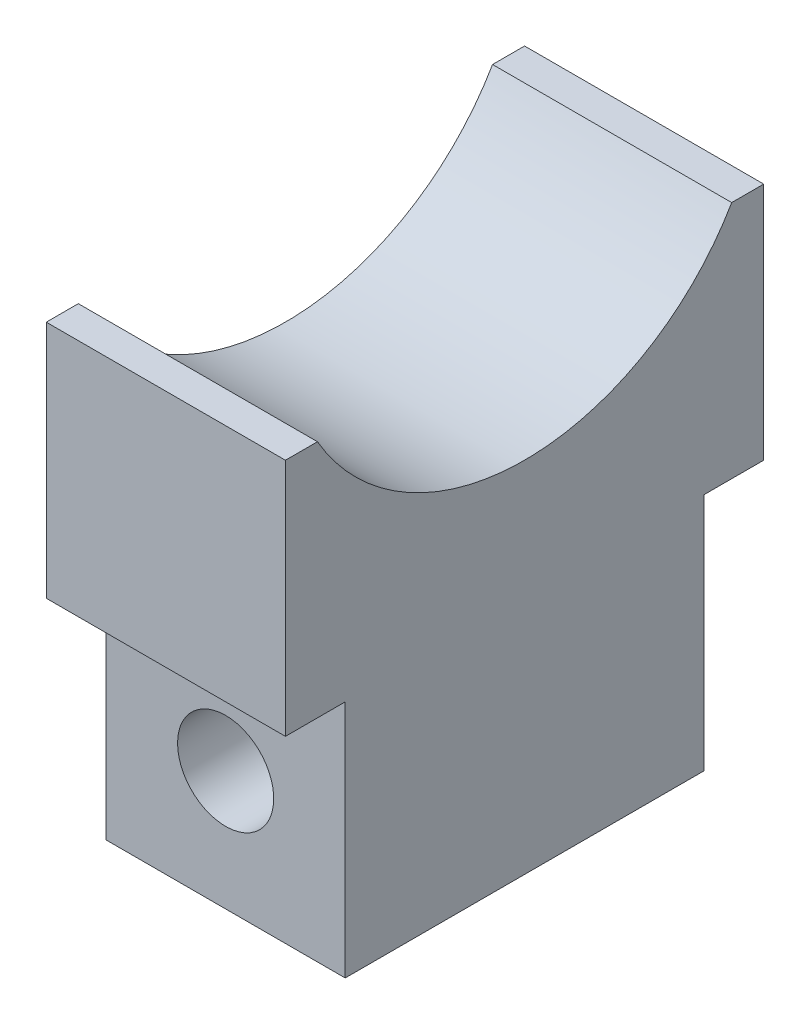
ISO-10303-21;
HEADER;
FILE_DESCRIPTION(('STEP AP214'),'2;1');
FILE_NAME('part.step','',(''),(''),'','','');
FILE_SCHEMA(('AUTOMOTIVE_DESIGN { 1 0 10303 214 1 1 1 1 }'));
ENDSEC;
DATA;
#1=APPLICATION_CONTEXT('core data for automotive mechanical design processes');
#2=APPLICATION_PROTOCOL_DEFINITION('international standard','automotive_design',2000,#1);
#3=PRODUCT_CONTEXT('',#1,'mechanical');
#4=PRODUCT('Part','Part','',(#3));
#5=PRODUCT_RELATED_PRODUCT_CATEGORY('part','',(#4));
#6=PRODUCT_DEFINITION_FORMATION('','',#4);
#7=PRODUCT_DEFINITION_CONTEXT('part definition',#1,'design');
#8=PRODUCT_DEFINITION('design','',#6,#7);
#9=PRODUCT_DEFINITION_SHAPE('','',#8);
#10=(LENGTH_UNIT() NAMED_UNIT(*) SI_UNIT(.MILLI.,.METRE.));
#11=(NAMED_UNIT(*) PLANE_ANGLE_UNIT() SI_UNIT($,.RADIAN.));
#12=(NAMED_UNIT(*) SI_UNIT($,.STERADIAN.) SOLID_ANGLE_UNIT());
#13=UNCERTAINTY_MEASURE_WITH_UNIT(LENGTH_MEASURE(1.E-05),#10,'distance_accuracy_value','');
#14=(GEOMETRIC_REPRESENTATION_CONTEXT(3) GLOBAL_UNCERTAINTY_ASSIGNED_CONTEXT((#13)) GLOBAL_UNIT_ASSIGNED_CONTEXT((#10,
#11,#12)) REPRESENTATION_CONTEXT('',''));
#15=CARTESIAN_POINT('',(0.,0.,0.));
#16=DIRECTION('',(0.,0.,1.));
#17=DIRECTION('',(1.,0.,0.));
#18=AXIS2_PLACEMENT_3D('',#15,#16,#17);
#19=CARTESIAN_POINT('',(6.35,12.7,25.4));
#20=DIRECTION('',(0.,-1.,0.));
#21=DIRECTION('',(0.,0.,-1.));
#22=AXIS2_PLACEMENT_3D('',#19,#20,#21);
#23=PLANE('',#22);
#24=DIRECTION('',(0.,0.,-1.));
#25=VECTOR('',#24,1.);
#26=CARTESIAN_POINT('',(6.35,12.7,25.4));
#27=LINE('',#26,#25);
#28=CARTESIAN_POINT('',(6.35,12.7,25.4));
#29=VERTEX_POINT('',#28);
#30=CARTESIAN_POINT('',(6.35,12.7,23.6985226280624));
#31=VERTEX_POINT('',#30);
#32=EDGE_CURVE('E195',#29,#31,#27,.T.);
#33=ORIENTED_EDGE('',*,*,#32,.T.);
#34=DIRECTION('',(-1.,0.,0.));
#35=VECTOR('',#34,1.);
#36=CARTESIAN_POINT('',(6.35,12.7,23.6985226280624));
#37=LINE('',#36,#35);
#38=CARTESIAN_POINT('',(-6.35,12.7,23.6985226280624));
#39=VERTEX_POINT('',#38);
#40=EDGE_CURVE('E186',#31,#39,#37,.T.);
#41=ORIENTED_EDGE('',*,*,#40,.T.);
#42=DIRECTION('',(0.,0.,-1.));
#43=VECTOR('',#42,1.);
#44=CARTESIAN_POINT('',(-6.35,12.7,25.4));
#45=LINE('',#44,#43);
#46=CARTESIAN_POINT('',(-6.35,12.7,25.4));
#47=VERTEX_POINT('',#46);
#48=EDGE_CURVE('E190',#47,#39,#45,.T.);
#49=ORIENTED_EDGE('',*,*,#48,.F.);
#50=DIRECTION('',(-1.,0.,0.));
#51=VECTOR('',#50,1.);
#52=CARTESIAN_POINT('',(6.35,12.7,25.4));
#53=LINE('',#52,#51);
#54=EDGE_CURVE('E221',#29,#47,#53,.T.);
#55=ORIENTED_EDGE('',*,*,#54,.F.);
#56=EDGE_LOOP('',(#33,#41,#49,#55));
#57=FACE_BOUND('',#56,.T.);
#58=ADVANCED_FACE('F79',(#57),#23,.F.);
#59=CARTESIAN_POINT('',(-6.35,-12.7,25.4));
#60=DIRECTION('',(1.,0.,0.));
#61=DIRECTION('',(0.,0.,-1.));
#62=AXIS2_PLACEMENT_3D('',#59,#60,#61);
#63=PLANE('',#62);
#64=ORIENTED_EDGE('',*,*,#48,.T.);
#65=CARTESIAN_POINT('',(-6.35,19.05,12.7));
#66=DIRECTION('',(-1.,0.,0.));
#67=DIRECTION('',(0.,0.,1.));
#68=AXIS2_PLACEMENT_3D('',#65,#66,#67);
#69=CIRCLE('',#68,12.7);
#70=CARTESIAN_POINT('',(-6.35,12.7,1.70147737193763));
#71=VERTEX_POINT('',#70);
#72=EDGE_CURVE('E228',#71,#39,#69,.T.);
#73=ORIENTED_EDGE('',*,*,#72,.F.);
#74=CARTESIAN_POINT('',(-6.35,12.7,0.));
#75=VERTEX_POINT('',#74);
#76=EDGE_CURVE('E194',#71,#75,#45,.T.);
#77=ORIENTED_EDGE('',*,*,#76,.T.);
#78=DIRECTION('',(0.,-1.,0.));
#79=VECTOR('',#78,1.);
#80=CARTESIAN_POINT('',(-6.35,-12.7,0.));
#81=LINE('',#80,#79);
#82=CARTESIAN_POINT('',(-6.35,0.,0.));
#83=VERTEX_POINT('',#82);
#84=EDGE_CURVE('E182',#75,#83,#81,.T.);
#85=ORIENTED_EDGE('',*,*,#84,.T.);
#86=DIRECTION('',(0.,0.,-1.));
#87=VECTOR('',#86,1.);
#88=CARTESIAN_POINT('',(-6.35,0.,0.));
#89=LINE('',#88,#87);
#90=CARTESIAN_POINT('',(-6.35,0.,3.175));
#91=VERTEX_POINT('',#90);
#92=EDGE_CURVE('E162',#91,#83,#89,.T.);
#93=ORIENTED_EDGE('',*,*,#92,.F.);
#94=DIRECTION('',(0.,1.,0.));
#95=VECTOR('',#94,1.);
#96=CARTESIAN_POINT('',(-6.35,0.,3.175));
#97=LINE('',#96,#95);
#98=CARTESIAN_POINT('',(-6.35,-12.7,3.175));
#99=VERTEX_POINT('',#98);
#100=EDGE_CURVE('E251',#99,#91,#97,.T.);
#101=ORIENTED_EDGE('',*,*,#100,.F.);
#102=DIRECTION('',(0.,0.,-1.));
#103=VECTOR('',#102,1.);
#104=CARTESIAN_POINT('',(-6.35,-12.7,25.4));
#105=LINE('',#104,#103);
#106=CARTESIAN_POINT('',(-6.35,-12.7,22.225));
#107=VERTEX_POINT('',#106);
#108=EDGE_CURVE('E13',#107,#99,#105,.T.);
#109=ORIENTED_EDGE('',*,*,#108,.F.);
#110=DIRECTION('',(0.,-1.,0.));
#111=VECTOR('',#110,1.);
#112=CARTESIAN_POINT('',(-6.35,0.,22.225));
#113=LINE('',#112,#111);
#114=CARTESIAN_POINT('',(-6.35,0.,22.225));
#115=VERTEX_POINT('',#114);
#116=EDGE_CURVE('E253',#115,#107,#113,.T.);
#117=ORIENTED_EDGE('',*,*,#116,.F.);
#118=DIRECTION('',(0.,0.,-1.));
#119=VECTOR('',#118,1.);
#120=CARTESIAN_POINT('',(-6.35,0.,0.));
#121=LINE('',#120,#119);
#122=CARTESIAN_POINT('',(-6.35,0.,25.4));
#123=VERTEX_POINT('',#122);
#124=EDGE_CURVE('E233',#123,#115,#121,.T.);
#125=ORIENTED_EDGE('',*,*,#124,.F.);
#126=DIRECTION('',(0.,-1.,0.));
#127=VECTOR('',#126,1.);
#128=CARTESIAN_POINT('',(-6.35,-12.7,25.4));
#129=LINE('',#128,#127);
#130=EDGE_CURVE('E184',#47,#123,#129,.T.);
#131=ORIENTED_EDGE('',*,*,#130,.F.);
#132=EDGE_LOOP('',(#64,#73,#77,#85,#93,#101,#109,#117,#125,#131));
#133=FACE_BOUND('',#132,.T.);
#134=ADVANCED_FACE('F81',(#133),#63,.F.);
#135=CARTESIAN_POINT('',(6.35,-12.7,25.4));
#136=DIRECTION('',(0.,1.,0.));
#137=DIRECTION('',(0.,0.,1.));
#138=AXIS2_PLACEMENT_3D('',#135,#136,#137);
#139=PLANE('',#138);
#140=DIRECTION('',(0.,0.,-1.));
#141=VECTOR('',#140,1.);
#142=CARTESIAN_POINT('',(6.35,-12.7,25.4));
#143=LINE('',#142,#141);
#144=CARTESIAN_POINT('',(6.35,-12.7,22.225));
#145=VERTEX_POINT('',#144);
#146=CARTESIAN_POINT('',(6.35,-12.7,3.175));
#147=VERTEX_POINT('',#146);
#148=EDGE_CURVE('E87',#145,#147,#143,.T.);
#149=ORIENTED_EDGE('',*,*,#148,.F.);
#150=DIRECTION('',(-1.,0.,0.));
#151=VECTOR('',#150,1.);
#152=CARTESIAN_POINT('',(6.35,-12.7,22.225));
#153=LINE('',#152,#151);
#154=EDGE_CURVE('E205',#145,#107,#153,.T.);
#155=ORIENTED_EDGE('',*,*,#154,.T.);
#156=ORIENTED_EDGE('',*,*,#108,.T.);
#157=DIRECTION('',(-1.,0.,0.));
#158=VECTOR('',#157,1.);
#159=CARTESIAN_POINT('',(6.35,-12.7,3.175));
#160=LINE('',#159,#158);
#161=EDGE_CURVE('E207',#147,#99,#160,.T.);
#162=ORIENTED_EDGE('',*,*,#161,.F.);
#163=EDGE_LOOP('',(#149,#155,#156,#162));
#164=FACE_BOUND('',#163,.T.);
#165=ADVANCED_FACE('F204',(#164),#139,.F.);
#166=CARTESIAN_POINT('',(6.35,-12.7,25.4));
#167=DIRECTION('',(-1.,0.,0.));
#168=DIRECTION('',(0.,0.,1.));
#169=AXIS2_PLACEMENT_3D('',#166,#167,#168);
#170=PLANE('',#169);
#171=CARTESIAN_POINT('',(6.35,12.7,1.70147737193763));
#172=VERTEX_POINT('',#171);
#173=CARTESIAN_POINT('',(6.35,12.7,0.));
#174=VERTEX_POINT('',#173);
#175=EDGE_CURVE('E193',#172,#174,#27,.T.);
#176=ORIENTED_EDGE('',*,*,#175,.F.);
#177=CARTESIAN_POINT('',(6.35,19.05,12.7));
#178=DIRECTION('',(-1.,0.,0.));
#179=DIRECTION('',(0.,0.,1.));
#180=AXIS2_PLACEMENT_3D('',#177,#178,#179);
#181=CIRCLE('',#180,12.7);
#182=EDGE_CURVE('E94',#172,#31,#181,.T.);
#183=ORIENTED_EDGE('',*,*,#182,.T.);
#184=ORIENTED_EDGE('',*,*,#32,.F.);
#185=DIRECTION('',(0.,1.,0.));
#186=VECTOR('',#185,1.);
#187=CARTESIAN_POINT('',(6.35,-12.7,25.4));
#188=LINE('',#187,#186);
#189=CARTESIAN_POINT('',(6.35,0.,25.4));
#190=VERTEX_POINT('',#189);
#191=EDGE_CURVE('E220',#190,#29,#188,.T.);
#192=ORIENTED_EDGE('',*,*,#191,.F.);
#193=DIRECTION('',(0.,0.,-1.));
#194=VECTOR('',#193,1.);
#195=CARTESIAN_POINT('',(6.35,0.,0.));
#196=LINE('',#195,#194);
#197=CARTESIAN_POINT('',(6.35,0.,22.225));
#198=VERTEX_POINT('',#197);
#199=EDGE_CURVE('E102',#190,#198,#196,.T.);
#200=ORIENTED_EDGE('',*,*,#199,.T.);
#201=DIRECTION('',(0.,-1.,0.));
#202=VECTOR('',#201,1.);
#203=CARTESIAN_POINT('',(6.35,0.,22.225));
#204=LINE('',#203,#202);
#205=EDGE_CURVE('E200',#198,#145,#204,.T.);
#206=ORIENTED_EDGE('',*,*,#205,.T.);
#207=ORIENTED_EDGE('',*,*,#148,.T.);
#208=DIRECTION('',(0.,1.,0.));
#209=VECTOR('',#208,1.);
#210=CARTESIAN_POINT('',(6.35,0.,3.175));
#211=LINE('',#210,#209);
#212=CARTESIAN_POINT('',(6.35,0.,3.175));
#213=VERTEX_POINT('',#212);
#214=EDGE_CURVE('E177',#147,#213,#211,.T.);
#215=ORIENTED_EDGE('',*,*,#214,.T.);
#216=DIRECTION('',(0.,0.,-1.));
#217=VECTOR('',#216,1.);
#218=CARTESIAN_POINT('',(6.35,0.,0.));
#219=LINE('',#218,#217);
#220=CARTESIAN_POINT('',(6.35,0.,0.));
#221=VERTEX_POINT('',#220);
#222=EDGE_CURVE('E159',#213,#221,#219,.T.);
#223=ORIENTED_EDGE('',*,*,#222,.T.);
#224=DIRECTION('',(0.,1.,0.));
#225=VECTOR('',#224,1.);
#226=CARTESIAN_POINT('',(6.35,-12.7,0.));
#227=LINE('',#226,#225);
#228=EDGE_CURVE('E174',#221,#174,#227,.T.);
#229=ORIENTED_EDGE('',*,*,#228,.T.);
#230=EDGE_LOOP('',(#176,#183,#184,#192,#200,#206,#207,#215,#223,#229));
#231=FACE_BOUND('',#230,.T.);
#232=ADVANCED_FACE('F173',(#231),#170,.F.);
#233=ORIENTED_EDGE('',*,*,#76,.F.);
#234=DIRECTION('',(-1.,0.,0.));
#235=VECTOR('',#234,1.);
#236=CARTESIAN_POINT('',(6.35,12.7,1.70147737193763));
#237=LINE('',#236,#235);
#238=EDGE_CURVE('E168',#172,#71,#237,.T.);
#239=ORIENTED_EDGE('',*,*,#238,.F.);
#240=ORIENTED_EDGE('',*,*,#175,.T.);
#241=DIRECTION('',(-1.,0.,0.));
#242=VECTOR('',#241,1.);
#243=CARTESIAN_POINT('',(6.35,12.7,0.));
#244=LINE('',#243,#242);
#245=EDGE_CURVE('E181',#174,#75,#244,.T.);
#246=ORIENTED_EDGE('',*,*,#245,.T.);
#247=EDGE_LOOP('',(#233,#239,#240,#246));
#248=FACE_BOUND('',#247,.T.);
#249=ADVANCED_FACE('F230',(#248),#23,.F.);
#250=CARTESIAN_POINT('',(0.,0.,25.4));
#251=DIRECTION('',(0.,0.,1.));
#252=DIRECTION('',(1.,0.,0.));
#253=AXIS2_PLACEMENT_3D('',#250,#251,#252);
#254=PLANE('',#253);
#255=DIRECTION('',(-1.,0.,0.));
#256=VECTOR('',#255,1.);
#257=CARTESIAN_POINT('',(6.35,0.,25.4));
#258=LINE('',#257,#256);
#259=EDGE_CURVE('E242',#190,#123,#258,.T.);
#260=ORIENTED_EDGE('',*,*,#259,.F.);
#261=ORIENTED_EDGE('',*,*,#191,.T.);
#262=ORIENTED_EDGE('',*,*,#54,.T.);
#263=ORIENTED_EDGE('',*,*,#130,.T.);
#264=EDGE_LOOP('',(#260,#261,#262,#263));
#265=FACE_BOUND('',#264,.T.);
#266=ADVANCED_FACE('F241',(#265),#254,.T.);
#267=CARTESIAN_POINT('',(0.,0.,0.));
#268=DIRECTION('',(0.,0.,1.));
#269=DIRECTION('',(1.,0.,0.));
#270=AXIS2_PLACEMENT_3D('',#267,#268,#269);
#271=PLANE('',#270);
#272=ORIENTED_EDGE('',*,*,#228,.F.);
#273=DIRECTION('',(-1.,0.,0.));
#274=VECTOR('',#273,1.);
#275=CARTESIAN_POINT('',(6.35,0.,0.));
#276=LINE('',#275,#274);
#277=EDGE_CURVE('E156',#221,#83,#276,.T.);
#278=ORIENTED_EDGE('',*,*,#277,.T.);
#279=ORIENTED_EDGE('',*,*,#84,.F.);
#280=ORIENTED_EDGE('',*,*,#245,.F.);
#281=EDGE_LOOP('',(#272,#278,#279,#280));
#282=FACE_BOUND('',#281,.T.);
#283=ADVANCED_FACE('F179',(#282),#271,.F.);
#284=CARTESIAN_POINT('',(6.35,0.,0.));
#285=DIRECTION('',(0.,1.,0.));
#286=DIRECTION('',(0.,0.,1.));
#287=AXIS2_PLACEMENT_3D('',#284,#285,#286);
#288=PLANE('',#287);
#289=ORIENTED_EDGE('',*,*,#92,.T.);
#290=ORIENTED_EDGE('',*,*,#277,.F.);
#291=ORIENTED_EDGE('',*,*,#222,.F.);
#292=DIRECTION('',(-1.,0.,0.));
#293=VECTOR('',#292,1.);
#294=CARTESIAN_POINT('',(6.35,0.,3.175));
#295=LINE('',#294,#293);
#296=EDGE_CURVE('E167',#213,#91,#295,.T.);
#297=ORIENTED_EDGE('',*,*,#296,.T.);
#298=EDGE_LOOP('',(#289,#290,#291,#297));
#299=FACE_BOUND('',#298,.T.);
#300=ADVANCED_FACE('F158',(#299),#288,.F.);
#301=CARTESIAN_POINT('',(6.35,0.,3.175));
#302=DIRECTION('',(0.,0.,1.));
#303=DIRECTION('',(0.,-1.,0.));
#304=AXIS2_PLACEMENT_3D('',#301,#302,#303);
#305=PLANE('',#304);
#306=CARTESIAN_POINT('',(0.,-6.35,3.175));
#307=DIRECTION('',(0.,0.,-1.));
#308=DIRECTION('',(0.,1.,0.));
#309=AXIS2_PLACEMENT_3D('',#306,#307,#308);
#310=CIRCLE('',#309,2.55269999999999);
#311=CARTESIAN_POINT('',(0.,-3.79730000000001,3.175));
#312=VERTEX_POINT('',#311);
#313=EDGE_CURVE('E263',#312,#312,#310,.T.);
#314=ORIENTED_EDGE('',*,*,#313,.F.);
#315=EDGE_LOOP('',(#314));
#316=FACE_BOUND('',#315,.T.);
#317=ORIENTED_EDGE('',*,*,#100,.T.);
#318=ORIENTED_EDGE('',*,*,#296,.F.);
#319=ORIENTED_EDGE('',*,*,#214,.F.);
#320=ORIENTED_EDGE('',*,*,#161,.T.);
#321=EDGE_LOOP('',(#317,#318,#319,#320));
#322=FACE_BOUND('',#321,.T.);
#323=ADVANCED_FACE('F259',(#316,#322),#305,.F.);
#324=CARTESIAN_POINT('',(6.35,0.,0.));
#325=DIRECTION('',(0.,1.,0.));
#326=DIRECTION('',(0.,0.,1.));
#327=AXIS2_PLACEMENT_3D('',#324,#325,#326);
#328=PLANE('',#327);
#329=ORIENTED_EDGE('',*,*,#124,.T.);
#330=DIRECTION('',(-1.,0.,0.));
#331=VECTOR('',#330,1.);
#332=CARTESIAN_POINT('',(6.35,0.,22.225));
#333=LINE('',#332,#331);
#334=EDGE_CURVE('E212',#198,#115,#333,.T.);
#335=ORIENTED_EDGE('',*,*,#334,.F.);
#336=ORIENTED_EDGE('',*,*,#199,.F.);
#337=ORIENTED_EDGE('',*,*,#259,.T.);
#338=EDGE_LOOP('',(#329,#335,#336,#337));
#339=FACE_BOUND('',#338,.T.);
#340=ADVANCED_FACE('F258',(#339),#328,.F.);
#341=CARTESIAN_POINT('',(6.35,0.,22.225));
#342=DIRECTION('',(0.,0.,-1.));
#343=DIRECTION('',(-1.,0.,0.));
#344=AXIS2_PLACEMENT_3D('',#341,#342,#343);
#345=PLANE('',#344);
#346=CARTESIAN_POINT('',(0.,-6.35,22.225));
#347=DIRECTION('',(0.,0.,-1.));
#348=DIRECTION('',(-1.,0.,0.));
#349=AXIS2_PLACEMENT_3D('',#346,#347,#348);
#350=CIRCLE('',#349,2.55269999999999);
#351=CARTESIAN_POINT('',(-2.55269999999999,-6.35,22.225));
#352=VERTEX_POINT('',#351);
#353=EDGE_CURVE('E249',#352,#352,#350,.T.);
#354=ORIENTED_EDGE('',*,*,#353,.T.);
#355=EDGE_LOOP('',(#354));
#356=FACE_BOUND('',#355,.T.);
#357=ORIENTED_EDGE('',*,*,#116,.T.);
#358=ORIENTED_EDGE('',*,*,#154,.F.);
#359=ORIENTED_EDGE('',*,*,#205,.F.);
#360=ORIENTED_EDGE('',*,*,#334,.T.);
#361=EDGE_LOOP('',(#357,#358,#359,#360));
#362=FACE_BOUND('',#361,.T.);
#363=ADVANCED_FACE('F257',(#356,#362),#345,.F.);
#364=CARTESIAN_POINT('',(6.35,19.05,12.7));
#365=DIRECTION('',(-1.,0.,0.));
#366=DIRECTION('',(0.,0.,1.));
#367=AXIS2_PLACEMENT_3D('',#364,#365,#366);
#368=CYLINDRICAL_SURFACE('',#367,12.7);
#369=ORIENTED_EDGE('',*,*,#72,.T.);
#370=ORIENTED_EDGE('',*,*,#40,.F.);
#371=ORIENTED_EDGE('',*,*,#182,.F.);
#372=ORIENTED_EDGE('',*,*,#238,.T.);
#373=EDGE_LOOP('',(#369,#370,#371,#372));
#374=FACE_BOUND('',#373,.T.);
#375=ADVANCED_FACE('F335',(#374),#368,.F.);
#376=CARTESIAN_POINT('',(0.,-6.35,3.175));
#377=DIRECTION('',(0.,0.,-1.));
#378=DIRECTION('',(0.,1.,0.));
#379=AXIS2_PLACEMENT_3D('',#376,#377,#378);
#380=CYLINDRICAL_SURFACE('',#379,2.55269999999999);
#381=ORIENTED_EDGE('',*,*,#313,.T.);
#382=EDGE_LOOP('',(#381));
#383=FACE_BOUND('',#382,.T.);
#384=ORIENTED_EDGE('',*,*,#353,.F.);
#385=EDGE_LOOP('',(#384));
#386=FACE_BOUND('',#385,.T.);
#387=ADVANCED_FACE('F267',(#383,#386),#380,.F.);
#388=CLOSED_SHELL('',(#58,#134,#165,#232,#249,#266,#283,#300,#323,#340,#363,#375,#387));
#389=MANIFOLD_SOLID_BREP('B2',#388);
#390=ADVANCED_BREP_SHAPE_REPRESENTATION('',(#18,#389),#14);
#391=SHAPE_DEFINITION_REPRESENTATION(#9,#390);
ENDSEC;
END-ISO-10303-21;
